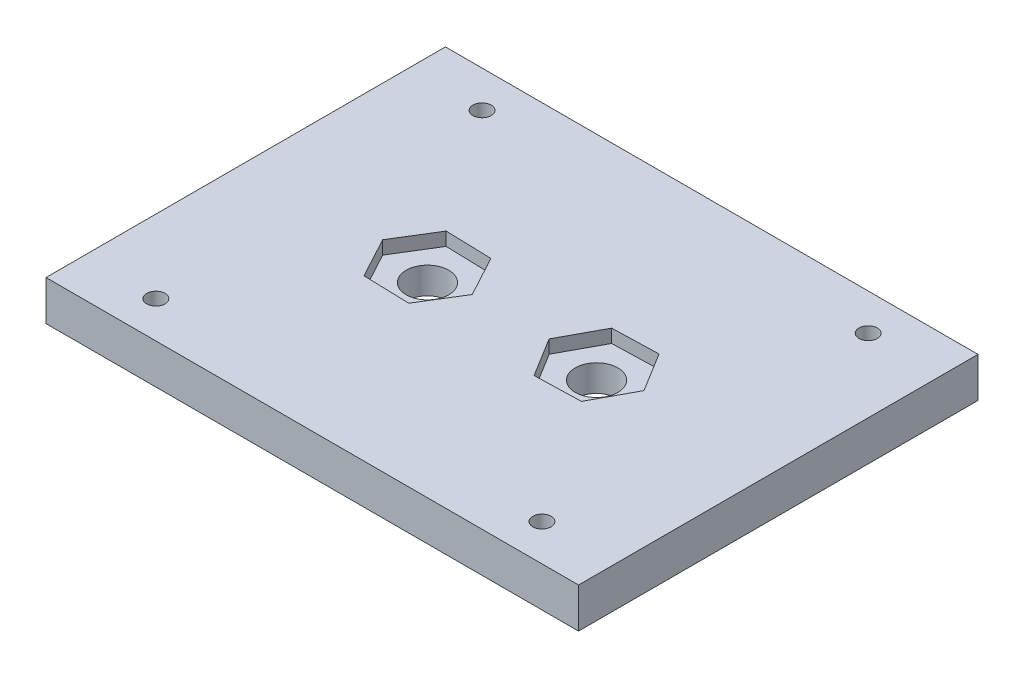
ISO-10303-21;
HEADER;
FILE_DESCRIPTION(('STEP AP214'),'2;1');
FILE_NAME('part.step','',(''),(''),'','','');
FILE_SCHEMA(('AUTOMOTIVE_DESIGN { 1 0 10303 214 1 1 1 1 }'));
ENDSEC;
DATA;
#1=APPLICATION_CONTEXT('core data for automotive mechanical design processes');
#2=APPLICATION_PROTOCOL_DEFINITION('international standard','automotive_design',2000,#1);
#3=PRODUCT_CONTEXT('',#1,'mechanical');
#4=PRODUCT('Part','Part','',(#3));
#5=PRODUCT_RELATED_PRODUCT_CATEGORY('part','',(#4));
#6=PRODUCT_DEFINITION_FORMATION('','',#4);
#7=PRODUCT_DEFINITION_CONTEXT('part definition',#1,'design');
#8=PRODUCT_DEFINITION('design','',#6,#7);
#9=PRODUCT_DEFINITION_SHAPE('','',#8);
#10=(LENGTH_UNIT() NAMED_UNIT(*) SI_UNIT(.MILLI.,.METRE.));
#11=(NAMED_UNIT(*) PLANE_ANGLE_UNIT() SI_UNIT($,.RADIAN.));
#12=(NAMED_UNIT(*) SI_UNIT($,.STERADIAN.) SOLID_ANGLE_UNIT());
#13=UNCERTAINTY_MEASURE_WITH_UNIT(LENGTH_MEASURE(1.E-05),#10,'distance_accuracy_value','');
#14=(GEOMETRIC_REPRESENTATION_CONTEXT(3) GLOBAL_UNCERTAINTY_ASSIGNED_CONTEXT((#13)) GLOBAL_UNIT_ASSIGNED_CONTEXT((#10,
#11,#12)) REPRESENTATION_CONTEXT('',''));
#15=CARTESIAN_POINT('',(0.,0.,0.));
#16=DIRECTION('',(0.,0.,1.));
#17=DIRECTION('',(1.,0.,0.));
#18=AXIS2_PLACEMENT_3D('',#15,#16,#17);
#19=CARTESIAN_POINT('',(0.,6.,0.));
#20=DIRECTION('',(0.,1.,0.));
#21=DIRECTION('',(0.,0.,1.));
#22=AXIS2_PLACEMENT_3D('',#19,#20,#21);
#23=PLANE('',#22);
#24=CARTESIAN_POINT('',(29.,6.,-24.5));
#25=DIRECTION('',(0.,-1.,0.));
#26=DIRECTION('',(0.,0.,1.));
#27=AXIS2_PLACEMENT_3D('',#24,#25,#26);
#28=CIRCLE('',#27,1.375);
#29=CARTESIAN_POINT('',(29.,6.,-23.125));
#30=VERTEX_POINT('',#29);
#31=EDGE_CURVE('E522',#30,#30,#28,.T.);
#32=ORIENTED_EDGE('',*,*,#31,.T.);
#33=EDGE_LOOP('',(#32));
#34=FACE_BOUND('',#33,.T.);
#35=CARTESIAN_POINT('',(29.,6.,24.5));
#36=DIRECTION('',(0.,1.,0.));
#37=DIRECTION('',(0.,0.,-1.));
#38=AXIS2_PLACEMENT_3D('',#35,#36,#37);
#39=CIRCLE('',#38,1.375);
#40=CARTESIAN_POINT('',(29.,6.,23.125));
#41=VERTEX_POINT('',#40);
#42=EDGE_CURVE('E527',#41,#41,#39,.T.);
#43=ORIENTED_EDGE('',*,*,#42,.F.);
#44=EDGE_LOOP('',(#43));
#45=FACE_BOUND('',#44,.T.);
#46=CARTESIAN_POINT('',(-29.,6.,24.5));
#47=DIRECTION('',(0.,-1.,0.));
#48=DIRECTION('',(0.,0.,-1.));
#49=AXIS2_PLACEMENT_3D('',#46,#47,#48);
#50=CIRCLE('',#49,1.375);
#51=CARTESIAN_POINT('',(-29.,6.,23.125));
#52=VERTEX_POINT('',#51);
#53=EDGE_CURVE('E536',#52,#52,#50,.T.);
#54=ORIENTED_EDGE('',*,*,#53,.T.);
#55=EDGE_LOOP('',(#54));
#56=FACE_BOUND('',#55,.T.);
#57=CARTESIAN_POINT('',(-29.,6.,-24.5));
#58=DIRECTION('',(0.,1.,0.));
#59=DIRECTION('',(0.,0.,1.));
#60=AXIS2_PLACEMENT_3D('',#57,#58,#59);
#61=CIRCLE('',#60,1.375);
#62=CARTESIAN_POINT('',(-29.,6.,-23.125));
#63=VERTEX_POINT('',#62);
#64=EDGE_CURVE('E539',#63,#63,#61,.T.);
#65=ORIENTED_EDGE('',*,*,#64,.F.);
#66=EDGE_LOOP('',(#65));
#67=FACE_BOUND('',#66,.T.);
#68=DIRECTION('',(0.,0.,-1.));
#69=VECTOR('',#68,1.);
#70=CARTESIAN_POINT('',(40.,6.,-30.));
#71=LINE('',#70,#69);
#72=CARTESIAN_POINT('',(40.,6.,30.));
#73=VERTEX_POINT('',#72);
#74=CARTESIAN_POINT('',(40.,6.,-30.));
#75=VERTEX_POINT('',#74);
#76=EDGE_CURVE('E260',#73,#75,#71,.T.);
#77=ORIENTED_EDGE('',*,*,#76,.T.);
#78=DIRECTION('',(-1.,0.,0.));
#79=VECTOR('',#78,1.);
#80=CARTESIAN_POINT('',(-40.,6.,-30.));
#81=LINE('',#80,#79);
#82=CARTESIAN_POINT('',(-40.,6.,-30.));
#83=VERTEX_POINT('',#82);
#84=EDGE_CURVE('E263',#75,#83,#81,.T.);
#85=ORIENTED_EDGE('',*,*,#84,.T.);
#86=DIRECTION('',(0.,0.,1.));
#87=VECTOR('',#86,1.);
#88=CARTESIAN_POINT('',(-40.,6.,-30.));
#89=LINE('',#88,#87);
#90=CARTESIAN_POINT('',(-40.,6.,30.));
#91=VERTEX_POINT('',#90);
#92=EDGE_CURVE('E266',#83,#91,#89,.T.);
#93=ORIENTED_EDGE('',*,*,#92,.T.);
#94=DIRECTION('',(1.,0.,0.));
#95=VECTOR('',#94,1.);
#96=CARTESIAN_POINT('',(-40.,6.,30.));
#97=LINE('',#96,#95);
#98=EDGE_CURVE('E268',#91,#73,#97,.T.);
#99=ORIENTED_EDGE('',*,*,#98,.T.);
#100=EDGE_LOOP('',(#77,#85,#93,#99));
#101=FACE_BOUND('',#100,.T.);
#102=DIRECTION('',(0.999588787431324,0.,0.0286750072637347));
#103=VECTOR('',#102,1.);
#104=CARTESIAN_POINT('',(-16.3347271765969,6.,5.89819958561155));
#105=LINE('',#104,#103);
#106=CARTESIAN_POINT('',(-16.3347271765969,6.,5.89819958561155));
#107=VERTEX_POINT('',#106);
#108=CARTESIAN_POINT('',(-9.40937291056797,6.,6.09686586356433));
#109=VERTEX_POINT('',#108);
#110=EDGE_CURVE('E60',#107,#109,#105,.T.);
#111=ORIENTED_EDGE('',*,*,#110,.F.);
#112=DIRECTION('',(0.474961108971564,0.,0.880006786885477));
#113=VECTOR('',#112,1.);
#114=CARTESIAN_POINT('',(-19.6253542660289,6.,-0.198666277952784));
#115=LINE('',#114,#113);
#116=CARTESIAN_POINT('',(-19.6253542660289,6.,-0.198666277952784));
#117=VERTEX_POINT('',#116);
#118=EDGE_CURVE('E213',#117,#107,#115,.T.);
#119=ORIENTED_EDGE('',*,*,#118,.F.);
#120=DIRECTION('',(-0.52462767845976,0.,0.851331779621742));
#121=VECTOR('',#120,1.);
#122=CARTESIAN_POINT('',(-15.990627089432,6.,-6.09686586356433));
#123=LINE('',#122,#121);
#124=CARTESIAN_POINT('',(-15.990627089432,6.,-6.09686586356433));
#125=VERTEX_POINT('',#124);
#126=EDGE_CURVE('E239',#125,#117,#123,.T.);
#127=ORIENTED_EDGE('',*,*,#126,.F.);
#128=DIRECTION('',(-0.999588787431324,0.,-0.0286750072637349));
#129=VECTOR('',#128,1.);
#130=CARTESIAN_POINT('',(-9.06527282340315,6.,-5.89819958561155));
#131=LINE('',#130,#129);
#132=CARTESIAN_POINT('',(-9.06527282340315,6.,-5.89819958561155));
#133=VERTEX_POINT('',#132);
#134=EDGE_CURVE('E236',#133,#125,#131,.T.);
#135=ORIENTED_EDGE('',*,*,#134,.F.);
#136=DIRECTION('',(-0.474961108971564,0.,-0.880006786885477));
#137=VECTOR('',#136,1.);
#138=CARTESIAN_POINT('',(-5.77464573397112,6.,0.198666277952784));
#139=LINE('',#138,#137);
#140=CARTESIAN_POINT('',(-5.77464573397112,6.,0.198666277952784));
#141=VERTEX_POINT('',#140);
#142=EDGE_CURVE('E233',#141,#133,#139,.T.);
#143=ORIENTED_EDGE('',*,*,#142,.F.);
#144=DIRECTION('',(0.52462767845976,0.,-0.851331779621742));
#145=VECTOR('',#144,1.);
#146=CARTESIAN_POINT('',(-9.40937291056797,6.,6.09686586356433));
#147=LINE('',#146,#145);
#148=EDGE_CURVE('E230',#109,#141,#147,.T.);
#149=ORIENTED_EDGE('',*,*,#148,.F.);
#150=EDGE_LOOP('',(#111,#119,#127,#135,#143,#149));
#151=FACE_BOUND('',#150,.T.);
#152=DIRECTION('',(-0.474961108971564,0.,0.880006786885477));
#153=VECTOR('',#152,1.);
#154=CARTESIAN_POINT('',(19.6253542660289,6.,-0.198666277952784));
#155=LINE('',#154,#153);
#156=CARTESIAN_POINT('',(19.6253542660289,6.,-0.198666277952784));
#157=VERTEX_POINT('',#156);
#158=CARTESIAN_POINT('',(16.3347271765969,6.,5.89819958561155));
#159=VERTEX_POINT('',#158);
#160=EDGE_CURVE('E187',#157,#159,#155,.T.);
#161=ORIENTED_EDGE('',*,*,#160,.T.);
#162=DIRECTION('',(-0.999588787431324,0.,0.0286750072637347));
#163=VECTOR('',#162,1.);
#164=CARTESIAN_POINT('',(16.3347271765969,6.,5.89819958561155));
#165=LINE('',#164,#163);
#166=CARTESIAN_POINT('',(9.40937291056797,6.,6.09686586356433));
#167=VERTEX_POINT('',#166);
#168=EDGE_CURVE('E52',#159,#167,#165,.T.);
#169=ORIENTED_EDGE('',*,*,#168,.T.);
#170=DIRECTION('',(-0.52462767845976,0.,-0.851331779621742));
#171=VECTOR('',#170,1.);
#172=CARTESIAN_POINT('',(9.40937291056797,6.,6.09686586356433));
#173=LINE('',#172,#171);
#174=CARTESIAN_POINT('',(5.77464573397112,6.,0.198666277952784));
#175=VERTEX_POINT('',#174);
#176=EDGE_CURVE('E171',#167,#175,#173,.T.);
#177=ORIENTED_EDGE('',*,*,#176,.T.);
#178=DIRECTION('',(0.474961108971564,0.,-0.880006786885477));
#179=VECTOR('',#178,1.);
#180=CARTESIAN_POINT('',(5.77464573397112,6.,0.198666277952784));
#181=LINE('',#180,#179);
#182=CARTESIAN_POINT('',(9.06527282340315,6.,-5.89819958561155));
#183=VERTEX_POINT('',#182);
#184=EDGE_CURVE('E174',#175,#183,#181,.T.);
#185=ORIENTED_EDGE('',*,*,#184,.T.);
#186=DIRECTION('',(0.999588787431324,0.,-0.0286750072637349));
#187=VECTOR('',#186,1.);
#188=CARTESIAN_POINT('',(9.06527282340315,6.,-5.89819958561155));
#189=LINE('',#188,#187);
#190=CARTESIAN_POINT('',(15.990627089432,6.,-6.09686586356433));
#191=VERTEX_POINT('',#190);
#192=EDGE_CURVE('E192',#183,#191,#189,.T.);
#193=ORIENTED_EDGE('',*,*,#192,.T.);
#194=DIRECTION('',(0.52462767845976,0.,0.851331779621742));
#195=VECTOR('',#194,1.);
#196=CARTESIAN_POINT('',(15.990627089432,6.,-6.09686586356433));
#197=LINE('',#196,#195);
#198=EDGE_CURVE('E189',#191,#157,#197,.T.);
#199=ORIENTED_EDGE('',*,*,#198,.T.);
#200=EDGE_LOOP('',(#161,#169,#177,#185,#193,#199));
#201=FACE_BOUND('',#200,.T.);
#202=ADVANCED_FACE('F35',(#34,#45,#56,#67,#101,#151,#201),#23,.T.);
#203=CARTESIAN_POINT('',(12.7,-0.00100000000000013,0.));
#204=DIRECTION('',(0.,1.,0.));
#205=DIRECTION('',(0.,0.,1.));
#206=AXIS2_PLACEMENT_3D('',#203,#204,#205);
#207=CYLINDRICAL_SURFACE('',#206,3.2);
#208=CARTESIAN_POINT('',(12.7,0.,0.));
#209=DIRECTION('',(0.,1.,0.));
#210=DIRECTION('',(0.,0.,1.));
#211=AXIS2_PLACEMENT_3D('',#208,#209,#210);
#212=CIRCLE('',#211,3.2);
#213=CARTESIAN_POINT('',(12.7,0.,3.2));
#214=VERTEX_POINT('',#213);
#215=EDGE_CURVE('E206',#214,#214,#212,.T.);
#216=ORIENTED_EDGE('',*,*,#215,.F.);
#217=EDGE_LOOP('',(#216));
#218=FACE_BOUND('',#217,.T.);
#219=CARTESIAN_POINT('',(12.7,4.,0.));
#220=DIRECTION('',(0.,1.,0.));
#221=DIRECTION('',(0.,0.,1.));
#222=AXIS2_PLACEMENT_3D('',#219,#220,#221);
#223=CIRCLE('',#222,3.2);
#224=CARTESIAN_POINT('',(12.7,4.,3.2));
#225=VERTEX_POINT('',#224);
#226=EDGE_CURVE('E39',#225,#225,#223,.T.);
#227=ORIENTED_EDGE('',*,*,#226,.T.);
#228=EDGE_LOOP('',(#227));
#229=FACE_BOUND('',#228,.T.);
#230=ADVANCED_FACE('F291',(#218,#229),#207,.F.);
#231=CARTESIAN_POINT('',(-12.7,-0.00100000000000013,0.));
#232=DIRECTION('',(0.,1.,0.));
#233=DIRECTION('',(0.,0.,1.));
#234=AXIS2_PLACEMENT_3D('',#231,#232,#233);
#235=CYLINDRICAL_SURFACE('',#234,3.2);
#236=CARTESIAN_POINT('',(-12.7,0.,0.));
#237=DIRECTION('',(0.,1.,0.));
#238=DIRECTION('',(0.,0.,1.));
#239=AXIS2_PLACEMENT_3D('',#236,#237,#238);
#240=CIRCLE('',#239,3.2);
#241=CARTESIAN_POINT('',(-12.7,0.,3.2));
#242=VERTEX_POINT('',#241);
#243=EDGE_CURVE('E256',#242,#242,#240,.F.);
#244=ORIENTED_EDGE('',*,*,#243,.T.);
#245=EDGE_LOOP('',(#244));
#246=FACE_BOUND('',#245,.T.);
#247=CARTESIAN_POINT('',(-12.7,4.,0.));
#248=DIRECTION('',(0.,1.,0.));
#249=DIRECTION('',(0.,0.,1.));
#250=AXIS2_PLACEMENT_3D('',#247,#248,#249);
#251=CIRCLE('',#250,3.2);
#252=CARTESIAN_POINT('',(-12.7,4.,3.2));
#253=VERTEX_POINT('',#252);
#254=EDGE_CURVE('E246',#253,#253,#251,.F.);
#255=ORIENTED_EDGE('',*,*,#254,.F.);
#256=EDGE_LOOP('',(#255));
#257=FACE_BOUND('',#256,.T.);
#258=ADVANCED_FACE('F289',(#246,#257),#235,.F.);
#259=CARTESIAN_POINT('',(40.,6.,-30.));
#260=DIRECTION('',(-1.,0.,0.));
#261=DIRECTION('',(0.,0.,1.));
#262=AXIS2_PLACEMENT_3D('',#259,#260,#261);
#263=PLANE('',#262);
#264=DIRECTION('',(0.,0.,-1.));
#265=VECTOR('',#264,1.);
#266=CARTESIAN_POINT('',(40.,0.,-30.));
#267=LINE('',#266,#265);
#268=CARTESIAN_POINT('',(40.,0.,30.));
#269=VERTEX_POINT('',#268);
#270=CARTESIAN_POINT('',(40.,0.,-30.));
#271=VERTEX_POINT('',#270);
#272=EDGE_CURVE('E259',#269,#271,#267,.T.);
#273=ORIENTED_EDGE('',*,*,#272,.T.);
#274=DIRECTION('',(0.,-1.,0.));
#275=VECTOR('',#274,1.);
#276=CARTESIAN_POINT('',(40.,6.,-30.));
#277=LINE('',#276,#275);
#278=EDGE_CURVE('E11',#75,#271,#277,.T.);
#279=ORIENTED_EDGE('',*,*,#278,.F.);
#280=ORIENTED_EDGE('',*,*,#76,.F.);
#281=DIRECTION('',(0.,-1.,0.));
#282=VECTOR('',#281,1.);
#283=CARTESIAN_POINT('',(40.,6.,30.));
#284=LINE('',#283,#282);
#285=EDGE_CURVE('E270',#73,#269,#284,.T.);
#286=ORIENTED_EDGE('',*,*,#285,.T.);
#287=EDGE_LOOP('',(#273,#279,#280,#286));
#288=FACE_BOUND('',#287,.T.);
#289=ADVANCED_FACE('F37',(#288),#263,.F.);
#290=CARTESIAN_POINT('',(-40.,6.,-30.));
#291=DIRECTION('',(0.,0.,1.));
#292=DIRECTION('',(1.,0.,0.));
#293=AXIS2_PLACEMENT_3D('',#290,#291,#292);
#294=PLANE('',#293);
#295=DIRECTION('',(-1.,0.,0.));
#296=VECTOR('',#295,1.);
#297=CARTESIAN_POINT('',(-40.,0.,-30.));
#298=LINE('',#297,#296);
#299=CARTESIAN_POINT('',(-40.,0.,-30.));
#300=VERTEX_POINT('',#299);
#301=EDGE_CURVE('E273',#271,#300,#298,.T.);
#302=ORIENTED_EDGE('',*,*,#301,.T.);
#303=DIRECTION('',(0.,-1.,0.));
#304=VECTOR('',#303,1.);
#305=CARTESIAN_POINT('',(-40.,6.,-30.));
#306=LINE('',#305,#304);
#307=EDGE_CURVE('E44',#83,#300,#306,.T.);
#308=ORIENTED_EDGE('',*,*,#307,.F.);
#309=ORIENTED_EDGE('',*,*,#84,.F.);
#310=ORIENTED_EDGE('',*,*,#278,.T.);
#311=EDGE_LOOP('',(#302,#308,#309,#310));
#312=FACE_BOUND('',#311,.T.);
#313=ADVANCED_FACE('F298',(#312),#294,.F.);
#314=CARTESIAN_POINT('',(-40.,6.,-30.));
#315=DIRECTION('',(1.,0.,0.));
#316=DIRECTION('',(0.,0.,-1.));
#317=AXIS2_PLACEMENT_3D('',#314,#315,#316);
#318=PLANE('',#317);
#319=DIRECTION('',(0.,0.,1.));
#320=VECTOR('',#319,1.);
#321=CARTESIAN_POINT('',(-40.,0.,-30.));
#322=LINE('',#321,#320);
#323=CARTESIAN_POINT('',(-40.,0.,30.));
#324=VERTEX_POINT('',#323);
#325=EDGE_CURVE('E275',#300,#324,#322,.T.);
#326=ORIENTED_EDGE('',*,*,#325,.T.);
#327=DIRECTION('',(0.,-1.,0.));
#328=VECTOR('',#327,1.);
#329=CARTESIAN_POINT('',(-40.,6.,30.));
#330=LINE('',#329,#328);
#331=EDGE_CURVE('E280',#91,#324,#330,.T.);
#332=ORIENTED_EDGE('',*,*,#331,.F.);
#333=ORIENTED_EDGE('',*,*,#92,.F.);
#334=ORIENTED_EDGE('',*,*,#307,.T.);
#335=EDGE_LOOP('',(#326,#332,#333,#334));
#336=FACE_BOUND('',#335,.T.);
#337=ADVANCED_FACE('F318',(#336),#318,.F.);
#338=CARTESIAN_POINT('',(-40.,6.,30.));
#339=DIRECTION('',(0.,0.,-1.));
#340=DIRECTION('',(-1.,0.,0.));
#341=AXIS2_PLACEMENT_3D('',#338,#339,#340);
#342=PLANE('',#341);
#343=DIRECTION('',(1.,0.,0.));
#344=VECTOR('',#343,1.);
#345=CARTESIAN_POINT('',(-40.,0.,30.));
#346=LINE('',#345,#344);
#347=EDGE_CURVE('E264',#324,#269,#346,.T.);
#348=ORIENTED_EDGE('',*,*,#347,.T.);
#349=ORIENTED_EDGE('',*,*,#285,.F.);
#350=ORIENTED_EDGE('',*,*,#98,.F.);
#351=ORIENTED_EDGE('',*,*,#331,.T.);
#352=EDGE_LOOP('',(#348,#349,#350,#351));
#353=FACE_BOUND('',#352,.T.);
#354=ADVANCED_FACE('F314',(#353),#342,.F.);
#355=CARTESIAN_POINT('',(0.,0.,0.));
#356=DIRECTION('',(0.,1.,0.));
#357=DIRECTION('',(0.,0.,1.));
#358=AXIS2_PLACEMENT_3D('',#355,#356,#357);
#359=PLANE('',#358);
#360=CARTESIAN_POINT('',(29.,0.,-24.5));
#361=DIRECTION('',(0.,1.,0.));
#362=DIRECTION('',(0.,0.,1.));
#363=AXIS2_PLACEMENT_3D('',#360,#361,#362);
#364=CIRCLE('',#363,1.375);
#365=CARTESIAN_POINT('',(29.,0.,-23.125));
#366=VERTEX_POINT('',#365);
#367=EDGE_CURVE('E525',#366,#366,#364,.T.);
#368=ORIENTED_EDGE('',*,*,#367,.T.);
#369=EDGE_LOOP('',(#368));
#370=FACE_BOUND('',#369,.T.);
#371=CARTESIAN_POINT('',(29.,0.,24.5));
#372=DIRECTION('',(0.,1.,0.));
#373=DIRECTION('',(0.,0.,1.));
#374=AXIS2_PLACEMENT_3D('',#371,#372,#373);
#375=CIRCLE('',#374,1.375);
#376=CARTESIAN_POINT('',(29.,0.,25.875));
#377=VERTEX_POINT('',#376);
#378=EDGE_CURVE('E532',#377,#377,#375,.F.);
#379=ORIENTED_EDGE('',*,*,#378,.F.);
#380=EDGE_LOOP('',(#379));
#381=FACE_BOUND('',#380,.T.);
#382=CARTESIAN_POINT('',(-29.,0.,24.5));
#383=DIRECTION('',(0.,1.,0.));
#384=DIRECTION('',(0.,0.,1.));
#385=AXIS2_PLACEMENT_3D('',#382,#383,#384);
#386=CIRCLE('',#385,1.375);
#387=CARTESIAN_POINT('',(-29.,0.,25.875));
#388=VERTEX_POINT('',#387);
#389=EDGE_CURVE('E535',#388,#388,#386,.T.);
#390=ORIENTED_EDGE('',*,*,#389,.T.);
#391=EDGE_LOOP('',(#390));
#392=FACE_BOUND('',#391,.T.);
#393=CARTESIAN_POINT('',(-29.,0.,-24.5));
#394=DIRECTION('',(0.,1.,0.));
#395=DIRECTION('',(0.,0.,1.));
#396=AXIS2_PLACEMENT_3D('',#393,#394,#395);
#397=CIRCLE('',#396,1.375);
#398=CARTESIAN_POINT('',(-29.,0.,-23.125));
#399=VERTEX_POINT('',#398);
#400=EDGE_CURVE('E177',#399,#399,#397,.F.);
#401=ORIENTED_EDGE('',*,*,#400,.F.);
#402=EDGE_LOOP('',(#401));
#403=FACE_BOUND('',#402,.T.);
#404=ORIENTED_EDGE('',*,*,#215,.T.);
#405=EDGE_LOOP('',(#404));
#406=FACE_BOUND('',#405,.T.);
#407=ORIENTED_EDGE('',*,*,#243,.F.);
#408=EDGE_LOOP('',(#407));
#409=FACE_BOUND('',#408,.T.);
#410=ORIENTED_EDGE('',*,*,#272,.F.);
#411=ORIENTED_EDGE('',*,*,#347,.F.);
#412=ORIENTED_EDGE('',*,*,#325,.F.);
#413=ORIENTED_EDGE('',*,*,#301,.F.);
#414=EDGE_LOOP('',(#410,#411,#412,#413));
#415=FACE_BOUND('',#414,.T.);
#416=ADVANCED_FACE('F311',(#370,#381,#392,#403,#406,#409,#415),#359,.F.);
#417=CARTESIAN_POINT('',(0.,4.,0.));
#418=DIRECTION('',(0.,1.,0.));
#419=DIRECTION('',(0.,0.,1.));
#420=AXIS2_PLACEMENT_3D('',#417,#418,#419);
#421=PLANE('',#420);
#422=DIRECTION('',(0.999588787431324,0.,0.0286750072637347));
#423=VECTOR('',#422,1.);
#424=CARTESIAN_POINT('',(-16.3347271765969,4.,5.89819958561155));
#425=LINE('',#424,#423);
#426=CARTESIAN_POINT('',(-16.3347271765969,4.,5.89819958561155));
#427=VERTEX_POINT('',#426);
#428=CARTESIAN_POINT('',(-9.40937291056797,4.,6.09686586356433));
#429=VERTEX_POINT('',#428);
#430=EDGE_CURVE('E209',#427,#429,#425,.T.);
#431=ORIENTED_EDGE('',*,*,#430,.T.);
#432=DIRECTION('',(0.52462767845976,0.,-0.851331779621742));
#433=VECTOR('',#432,1.);
#434=CARTESIAN_POINT('',(-9.40937291056797,4.,6.09686586356433));
#435=LINE('',#434,#433);
#436=CARTESIAN_POINT('',(-5.77464573397112,4.,0.198666277952784));
#437=VERTEX_POINT('',#436);
#438=EDGE_CURVE('E212',#429,#437,#435,.T.);
#439=ORIENTED_EDGE('',*,*,#438,.T.);
#440=DIRECTION('',(-0.474961108971564,0.,-0.880006786885477));
#441=VECTOR('',#440,1.);
#442=CARTESIAN_POINT('',(-5.77464573397112,4.,0.198666277952784));
#443=LINE('',#442,#441);
#444=CARTESIAN_POINT('',(-9.06527282340315,4.,-5.89819958561155));
#445=VERTEX_POINT('',#444);
#446=EDGE_CURVE('E216',#437,#445,#443,.T.);
#447=ORIENTED_EDGE('',*,*,#446,.T.);
#448=DIRECTION('',(-0.999588787431324,0.,-0.0286750072637349));
#449=VECTOR('',#448,1.);
#450=CARTESIAN_POINT('',(-9.06527282340315,4.,-5.89819958561155));
#451=LINE('',#450,#449);
#452=CARTESIAN_POINT('',(-15.990627089432,4.,-6.09686586356433));
#453=VERTEX_POINT('',#452);
#454=EDGE_CURVE('E219',#445,#453,#451,.T.);
#455=ORIENTED_EDGE('',*,*,#454,.T.);
#456=DIRECTION('',(-0.52462767845976,0.,0.851331779621742));
#457=VECTOR('',#456,1.);
#458=CARTESIAN_POINT('',(-15.990627089432,4.,-6.09686586356433));
#459=LINE('',#458,#457);
#460=CARTESIAN_POINT('',(-19.6253542660289,4.,-0.198666277952784));
#461=VERTEX_POINT('',#460);
#462=EDGE_CURVE('E222',#453,#461,#459,.T.);
#463=ORIENTED_EDGE('',*,*,#462,.T.);
#464=DIRECTION('',(0.474961108971564,0.,0.880006786885477));
#465=VECTOR('',#464,1.);
#466=CARTESIAN_POINT('',(-19.6253542660289,4.,-0.198666277952784));
#467=LINE('',#466,#465);
#468=EDGE_CURVE('E225',#461,#427,#467,.T.);
#469=ORIENTED_EDGE('',*,*,#468,.T.);
#470=EDGE_LOOP('',(#431,#439,#447,#455,#463,#469));
#471=FACE_BOUND('',#470,.T.);
#472=ORIENTED_EDGE('',*,*,#254,.T.);
#473=EDGE_LOOP('',(#472));
#474=FACE_BOUND('',#473,.T.);
#475=ADVANCED_FACE('F287',(#471,#474),#421,.T.);
#476=CARTESIAN_POINT('',(-16.3347271765969,4.,5.89819958561155));
#477=DIRECTION('',(-0.0286750072637347,0.,0.999588787431324));
#478=DIRECTION('',(0.999588787431324,0.,0.0286750072637347));
#479=AXIS2_PLACEMENT_3D('',#476,#477,#478);
#480=PLANE('',#479);
#481=ORIENTED_EDGE('',*,*,#110,.T.);
#482=DIRECTION('',(0.,1.,0.));
#483=VECTOR('',#482,1.);
#484=CARTESIAN_POINT('',(-9.40937291056797,4.,6.09686586356433));
#485=LINE('',#484,#483);
#486=EDGE_CURVE('E228',#429,#109,#485,.T.);
#487=ORIENTED_EDGE('',*,*,#486,.F.);
#488=ORIENTED_EDGE('',*,*,#430,.F.);
#489=DIRECTION('',(0.,1.,0.));
#490=VECTOR('',#489,1.);
#491=CARTESIAN_POINT('',(-16.3347271765969,4.,5.89819958561155));
#492=LINE('',#491,#490);
#493=EDGE_CURVE('E244',#427,#107,#492,.T.);
#494=ORIENTED_EDGE('',*,*,#493,.T.);
#495=EDGE_LOOP('',(#481,#487,#488,#494));
#496=FACE_BOUND('',#495,.T.);
#497=ADVANCED_FACE('F377',(#496),#480,.F.);
#498=CARTESIAN_POINT('',(-19.6253542660289,4.,-0.198666277952784));
#499=DIRECTION('',(-0.880006786885478,0.,0.474961108971564));
#500=DIRECTION('',(0.474961108971564,0.,0.880006786885477));
#501=AXIS2_PLACEMENT_3D('',#498,#499,#500);
#502=PLANE('',#501);
#503=ORIENTED_EDGE('',*,*,#118,.T.);
#504=ORIENTED_EDGE('',*,*,#493,.F.);
#505=ORIENTED_EDGE('',*,*,#468,.F.);
#506=DIRECTION('',(0.,1.,0.));
#507=VECTOR('',#506,1.);
#508=CARTESIAN_POINT('',(-19.6253542660289,4.,-0.198666277952784));
#509=LINE('',#508,#507);
#510=EDGE_CURVE('E247',#461,#117,#509,.T.);
#511=ORIENTED_EDGE('',*,*,#510,.T.);
#512=EDGE_LOOP('',(#503,#504,#505,#511));
#513=FACE_BOUND('',#512,.T.);
#514=ADVANCED_FACE('F379',(#513),#502,.F.);
#515=CARTESIAN_POINT('',(-15.990627089432,4.,-6.09686586356433));
#516=DIRECTION('',(-0.851331779621742,0.,-0.52462767845976));
#517=DIRECTION('',(-0.52462767845976,0.,0.851331779621742));
#518=AXIS2_PLACEMENT_3D('',#515,#516,#517);
#519=PLANE('',#518);
#520=ORIENTED_EDGE('',*,*,#126,.T.);
#521=ORIENTED_EDGE('',*,*,#510,.F.);
#522=ORIENTED_EDGE('',*,*,#462,.F.);
#523=DIRECTION('',(0.,1.,0.));
#524=VECTOR('',#523,1.);
#525=CARTESIAN_POINT('',(-15.990627089432,4.,-6.09686586356433));
#526=LINE('',#525,#524);
#527=EDGE_CURVE('E249',#453,#125,#526,.T.);
#528=ORIENTED_EDGE('',*,*,#527,.T.);
#529=EDGE_LOOP('',(#520,#521,#522,#528));
#530=FACE_BOUND('',#529,.T.);
#531=ADVANCED_FACE('F382',(#530),#519,.F.);
#532=CARTESIAN_POINT('',(-9.06527282340315,4.,-5.89819958561155));
#533=DIRECTION('',(0.0286750072637349,0.,-0.999588787431324));
#534=DIRECTION('',(-0.999588787431324,0.,-0.0286750072637349));
#535=AXIS2_PLACEMENT_3D('',#532,#533,#534);
#536=PLANE('',#535);
#537=ORIENTED_EDGE('',*,*,#134,.T.);
#538=ORIENTED_EDGE('',*,*,#527,.F.);
#539=ORIENTED_EDGE('',*,*,#454,.F.);
#540=DIRECTION('',(0.,1.,0.));
#541=VECTOR('',#540,1.);
#542=CARTESIAN_POINT('',(-9.06527282340315,4.,-5.89819958561155));
#543=LINE('',#542,#541);
#544=EDGE_CURVE('E251',#445,#133,#543,.T.);
#545=ORIENTED_EDGE('',*,*,#544,.T.);
#546=EDGE_LOOP('',(#537,#538,#539,#545));
#547=FACE_BOUND('',#546,.T.);
#548=ADVANCED_FACE('F386',(#547),#536,.F.);
#549=CARTESIAN_POINT('',(-5.77464573397112,4.,0.198666277952784));
#550=DIRECTION('',(0.880006786885477,0.,-0.474961108971564));
#551=DIRECTION('',(-0.474961108971564,0.,-0.880006786885477));
#552=AXIS2_PLACEMENT_3D('',#549,#550,#551);
#553=PLANE('',#552);
#554=ORIENTED_EDGE('',*,*,#142,.T.);
#555=ORIENTED_EDGE('',*,*,#544,.F.);
#556=ORIENTED_EDGE('',*,*,#446,.F.);
#557=DIRECTION('',(0.,1.,0.));
#558=VECTOR('',#557,1.);
#559=CARTESIAN_POINT('',(-5.77464573397112,4.,0.198666277952784));
#560=LINE('',#559,#558);
#561=EDGE_CURVE('E253',#437,#141,#560,.T.);
#562=ORIENTED_EDGE('',*,*,#561,.T.);
#563=EDGE_LOOP('',(#554,#555,#556,#562));
#564=FACE_BOUND('',#563,.T.);
#565=ADVANCED_FACE('F390',(#564),#553,.F.);
#566=CARTESIAN_POINT('',(-9.40937291056797,4.,6.09686586356433));
#567=DIRECTION('',(0.851331779621742,0.,0.52462767845976));
#568=DIRECTION('',(0.52462767845976,0.,-0.851331779621742));
#569=AXIS2_PLACEMENT_3D('',#566,#567,#568);
#570=PLANE('',#569);
#571=ORIENTED_EDGE('',*,*,#148,.T.);
#572=ORIENTED_EDGE('',*,*,#561,.F.);
#573=ORIENTED_EDGE('',*,*,#438,.F.);
#574=ORIENTED_EDGE('',*,*,#486,.T.);
#575=EDGE_LOOP('',(#571,#572,#573,#574));
#576=FACE_BOUND('',#575,.T.);
#577=ADVANCED_FACE('F364',(#576),#570,.F.);
#578=CARTESIAN_POINT('',(16.3347271765969,4.,5.89819958561155));
#579=DIRECTION('',(-0.0286750072637347,0.,-0.999588787431324));
#580=DIRECTION('',(-0.999588787431324,0.,0.0286750072637347));
#581=AXIS2_PLACEMENT_3D('',#578,#579,#580);
#582=PLANE('',#581);
#583=ORIENTED_EDGE('',*,*,#168,.F.);
#584=DIRECTION('',(0.,1.,0.));
#585=VECTOR('',#584,1.);
#586=CARTESIAN_POINT('',(16.3347271765969,4.,5.89819958561155));
#587=LINE('',#586,#585);
#588=CARTESIAN_POINT('',(16.3347271765969,4.,5.89819958561155));
#589=VERTEX_POINT('',#588);
#590=EDGE_CURVE('E155',#589,#159,#587,.T.);
#591=ORIENTED_EDGE('',*,*,#590,.F.);
#592=DIRECTION('',(-0.999588787431324,0.,0.0286750072637347));
#593=VECTOR('',#592,1.);
#594=CARTESIAN_POINT('',(16.3347271765969,4.,5.89819958561155));
#595=LINE('',#594,#593);
#596=CARTESIAN_POINT('',(9.40937291056797,4.,6.09686586356433));
#597=VERTEX_POINT('',#596);
#598=EDGE_CURVE('E162',#589,#597,#595,.T.);
#599=ORIENTED_EDGE('',*,*,#598,.T.);
#600=DIRECTION('',(0.,1.,0.));
#601=VECTOR('',#600,1.);
#602=CARTESIAN_POINT('',(9.40937291056797,4.,6.09686586356433));
#603=LINE('',#602,#601);
#604=EDGE_CURVE('E197',#597,#167,#603,.T.);
#605=ORIENTED_EDGE('',*,*,#604,.T.);
#606=EDGE_LOOP('',(#583,#591,#599,#605));
#607=FACE_BOUND('',#606,.T.);
#608=ADVANCED_FACE('F165',(#607),#582,.T.);
#609=CARTESIAN_POINT('',(9.40937291056797,4.,6.09686586356433));
#610=DIRECTION('',(0.851331779621742,0.,-0.52462767845976));
#611=DIRECTION('',(-0.52462767845976,0.,-0.851331779621742));
#612=AXIS2_PLACEMENT_3D('',#609,#610,#611);
#613=PLANE('',#612);
#614=ORIENTED_EDGE('',*,*,#176,.F.);
#615=ORIENTED_EDGE('',*,*,#604,.F.);
#616=DIRECTION('',(-0.52462767845976,0.,-0.851331779621742));
#617=VECTOR('',#616,1.);
#618=CARTESIAN_POINT('',(9.40937291056797,4.,6.09686586356433));
#619=LINE('',#618,#617);
#620=CARTESIAN_POINT('',(5.77464573397112,4.,0.198666277952784));
#621=VERTEX_POINT('',#620);
#622=EDGE_CURVE('E167',#597,#621,#619,.T.);
#623=ORIENTED_EDGE('',*,*,#622,.T.);
#624=DIRECTION('',(0.,1.,0.));
#625=VECTOR('',#624,1.);
#626=CARTESIAN_POINT('',(5.77464573397112,4.,0.198666277952784));
#627=LINE('',#626,#625);
#628=EDGE_CURVE('E199',#621,#175,#627,.T.);
#629=ORIENTED_EDGE('',*,*,#628,.T.);
#630=EDGE_LOOP('',(#614,#615,#623,#629));
#631=FACE_BOUND('',#630,.T.);
#632=ADVANCED_FACE('F356',(#631),#613,.T.);
#633=CARTESIAN_POINT('',(5.77464573397112,4.,0.198666277952784));
#634=DIRECTION('',(0.880006786885477,0.,0.474961108971564));
#635=DIRECTION('',(0.474961108971564,0.,-0.880006786885477));
#636=AXIS2_PLACEMENT_3D('',#633,#634,#635);
#637=PLANE('',#636);
#638=ORIENTED_EDGE('',*,*,#184,.F.);
#639=ORIENTED_EDGE('',*,*,#628,.F.);
#640=DIRECTION('',(0.474961108971564,0.,-0.880006786885477));
#641=VECTOR('',#640,1.);
#642=CARTESIAN_POINT('',(5.77464573397112,4.,0.198666277952784));
#643=LINE('',#642,#641);
#644=CARTESIAN_POINT('',(9.06527282340315,4.,-5.89819958561155));
#645=VERTEX_POINT('',#644);
#646=EDGE_CURVE('E183',#621,#645,#643,.T.);
#647=ORIENTED_EDGE('',*,*,#646,.T.);
#648=DIRECTION('',(0.,1.,0.));
#649=VECTOR('',#648,1.);
#650=CARTESIAN_POINT('',(9.06527282340315,4.,-5.89819958561155));
#651=LINE('',#650,#649);
#652=EDGE_CURVE('E201',#645,#183,#651,.T.);
#653=ORIENTED_EDGE('',*,*,#652,.T.);
#654=EDGE_LOOP('',(#638,#639,#647,#653));
#655=FACE_BOUND('',#654,.T.);
#656=ADVANCED_FACE('F353',(#655),#637,.T.);
#657=CARTESIAN_POINT('',(9.06527282340315,4.,-5.89819958561155));
#658=DIRECTION('',(0.0286750072637349,0.,0.999588787431324));
#659=DIRECTION('',(0.999588787431324,0.,-0.0286750072637349));
#660=AXIS2_PLACEMENT_3D('',#657,#658,#659);
#661=PLANE('',#660);
#662=ORIENTED_EDGE('',*,*,#192,.F.);
#663=ORIENTED_EDGE('',*,*,#652,.F.);
#664=DIRECTION('',(0.999588787431324,0.,-0.0286750072637349));
#665=VECTOR('',#664,1.);
#666=CARTESIAN_POINT('',(9.06527282340315,4.,-5.89819958561155));
#667=LINE('',#666,#665);
#668=CARTESIAN_POINT('',(15.990627089432,4.,-6.09686586356433));
#669=VERTEX_POINT('',#668);
#670=EDGE_CURVE('E181',#645,#669,#667,.T.);
#671=ORIENTED_EDGE('',*,*,#670,.T.);
#672=DIRECTION('',(0.,1.,0.));
#673=VECTOR('',#672,1.);
#674=CARTESIAN_POINT('',(15.990627089432,4.,-6.09686586356433));
#675=LINE('',#674,#673);
#676=EDGE_CURVE('E203',#669,#191,#675,.T.);
#677=ORIENTED_EDGE('',*,*,#676,.T.);
#678=EDGE_LOOP('',(#662,#663,#671,#677));
#679=FACE_BOUND('',#678,.T.);
#680=ADVANCED_FACE('F350',(#679),#661,.T.);
#681=CARTESIAN_POINT('',(15.990627089432,4.,-6.09686586356433));
#682=DIRECTION('',(-0.851331779621742,0.,0.52462767845976));
#683=DIRECTION('',(0.52462767845976,0.,0.851331779621742));
#684=AXIS2_PLACEMENT_3D('',#681,#682,#683);
#685=PLANE('',#684);
#686=ORIENTED_EDGE('',*,*,#198,.F.);
#687=ORIENTED_EDGE('',*,*,#676,.F.);
#688=DIRECTION('',(0.52462767845976,0.,0.851331779621742));
#689=VECTOR('',#688,1.);
#690=CARTESIAN_POINT('',(15.990627089432,4.,-6.09686586356433));
#691=LINE('',#690,#689);
#692=CARTESIAN_POINT('',(19.6253542660289,4.,-0.198666277952784));
#693=VERTEX_POINT('',#692);
#694=EDGE_CURVE('E161',#669,#693,#691,.T.);
#695=ORIENTED_EDGE('',*,*,#694,.T.);
#696=DIRECTION('',(0.,1.,0.));
#697=VECTOR('',#696,1.);
#698=CARTESIAN_POINT('',(19.6253542660289,4.,-0.198666277952784));
#699=LINE('',#698,#697);
#700=EDGE_CURVE('E157',#693,#157,#699,.T.);
#701=ORIENTED_EDGE('',*,*,#700,.T.);
#702=EDGE_LOOP('',(#686,#687,#695,#701));
#703=FACE_BOUND('',#702,.T.);
#704=ADVANCED_FACE('F346',(#703),#685,.T.);
#705=CARTESIAN_POINT('',(19.6253542660289,4.,-0.198666277952784));
#706=DIRECTION('',(-0.880006786885478,0.,-0.474961108971564));
#707=DIRECTION('',(-0.474961108971564,0.,0.880006786885477));
#708=AXIS2_PLACEMENT_3D('',#705,#706,#707);
#709=PLANE('',#708);
#710=ORIENTED_EDGE('',*,*,#160,.F.);
#711=ORIENTED_EDGE('',*,*,#700,.F.);
#712=DIRECTION('',(-0.474961108971564,0.,0.880006786885477));
#713=VECTOR('',#712,1.);
#714=CARTESIAN_POINT('',(19.6253542660289,4.,-0.198666277952784));
#715=LINE('',#714,#713);
#716=EDGE_CURVE('E152',#693,#589,#715,.T.);
#717=ORIENTED_EDGE('',*,*,#716,.T.);
#718=ORIENTED_EDGE('',*,*,#590,.T.);
#719=EDGE_LOOP('',(#710,#711,#717,#718));
#720=FACE_BOUND('',#719,.T.);
#721=ADVANCED_FACE('F154',(#720),#709,.T.);
#722=CARTESIAN_POINT('',(0.,4.,0.));
#723=DIRECTION('',(0.,1.,0.));
#724=DIRECTION('',(0.,0.,1.));
#725=AXIS2_PLACEMENT_3D('',#722,#723,#724);
#726=PLANE('',#725);
#727=ORIENTED_EDGE('',*,*,#226,.F.);
#728=EDGE_LOOP('',(#727));
#729=FACE_BOUND('',#728,.T.);
#730=ORIENTED_EDGE('',*,*,#598,.F.);
#731=ORIENTED_EDGE('',*,*,#716,.F.);
#732=ORIENTED_EDGE('',*,*,#694,.F.);
#733=ORIENTED_EDGE('',*,*,#670,.F.);
#734=ORIENTED_EDGE('',*,*,#646,.F.);
#735=ORIENTED_EDGE('',*,*,#622,.F.);
#736=EDGE_LOOP('',(#730,#731,#732,#733,#734,#735));
#737=FACE_BOUND('',#736,.T.);
#738=ADVANCED_FACE('F169',(#729,#737),#726,.T.);
#739=CARTESIAN_POINT('',(-29.,-0.00100000000000013,-24.5));
#740=DIRECTION('',(0.,1.,0.));
#741=DIRECTION('',(0.,0.,1.));
#742=AXIS2_PLACEMENT_3D('',#739,#740,#741);
#743=CYLINDRICAL_SURFACE('',#742,1.375);
#744=ORIENTED_EDGE('',*,*,#64,.T.);
#745=EDGE_LOOP('',(#744));
#746=FACE_BOUND('',#745,.T.);
#747=ORIENTED_EDGE('',*,*,#400,.T.);
#748=EDGE_LOOP('',(#747));
#749=FACE_BOUND('',#748,.T.);
#750=ADVANCED_FACE('F467',(#746,#749),#743,.F.);
#751=CARTESIAN_POINT('',(-29.,-0.00100000000000013,24.5));
#752=DIRECTION('',(0.,1.,0.));
#753=DIRECTION('',(0.,0.,1.));
#754=AXIS2_PLACEMENT_3D('',#751,#752,#753);
#755=CYLINDRICAL_SURFACE('',#754,1.375);
#756=ORIENTED_EDGE('',*,*,#53,.F.);
#757=EDGE_LOOP('',(#756));
#758=FACE_BOUND('',#757,.T.);
#759=ORIENTED_EDGE('',*,*,#389,.F.);
#760=EDGE_LOOP('',(#759));
#761=FACE_BOUND('',#760,.T.);
#762=ADVANCED_FACE('F476',(#758,#761),#755,.F.);
#763=CARTESIAN_POINT('',(29.,-0.00100000000000013,24.5));
#764=DIRECTION('',(0.,1.,0.));
#765=DIRECTION('',(0.,0.,1.));
#766=AXIS2_PLACEMENT_3D('',#763,#764,#765);
#767=CYLINDRICAL_SURFACE('',#766,1.375);
#768=ORIENTED_EDGE('',*,*,#42,.T.);
#769=EDGE_LOOP('',(#768));
#770=FACE_BOUND('',#769,.T.);
#771=ORIENTED_EDGE('',*,*,#378,.T.);
#772=EDGE_LOOP('',(#771));
#773=FACE_BOUND('',#772,.T.);
#774=ADVANCED_FACE('F484',(#770,#773),#767,.F.);
#775=CARTESIAN_POINT('',(29.,-0.00100000000000013,-24.5));
#776=DIRECTION('',(0.,1.,0.));
#777=DIRECTION('',(0.,0.,1.));
#778=AXIS2_PLACEMENT_3D('',#775,#776,#777);
#779=CYLINDRICAL_SURFACE('',#778,1.375);
#780=ORIENTED_EDGE('',*,*,#31,.F.);
#781=EDGE_LOOP('',(#780));
#782=FACE_BOUND('',#781,.T.);
#783=ORIENTED_EDGE('',*,*,#367,.F.);
#784=EDGE_LOOP('',(#783));
#785=FACE_BOUND('',#784,.T.);
#786=ADVANCED_FACE('F506',(#782,#785),#779,.F.);
#787=CLOSED_SHELL('',(#202,#230,#258,#289,#313,#337,#354,#416,#475,#497,#514,#531,#548,#565,
#577,#608,#632,#656,#680,#704,#721,#738,#750,#762,#774,#786));
#788=MANIFOLD_SOLID_BREP('B2',#787);
#789=ADVANCED_BREP_SHAPE_REPRESENTATION('',(#18,#788),#14);
#790=SHAPE_DEFINITION_REPRESENTATION(#9,#789);
ENDSEC;
END-ISO-10303-21;
